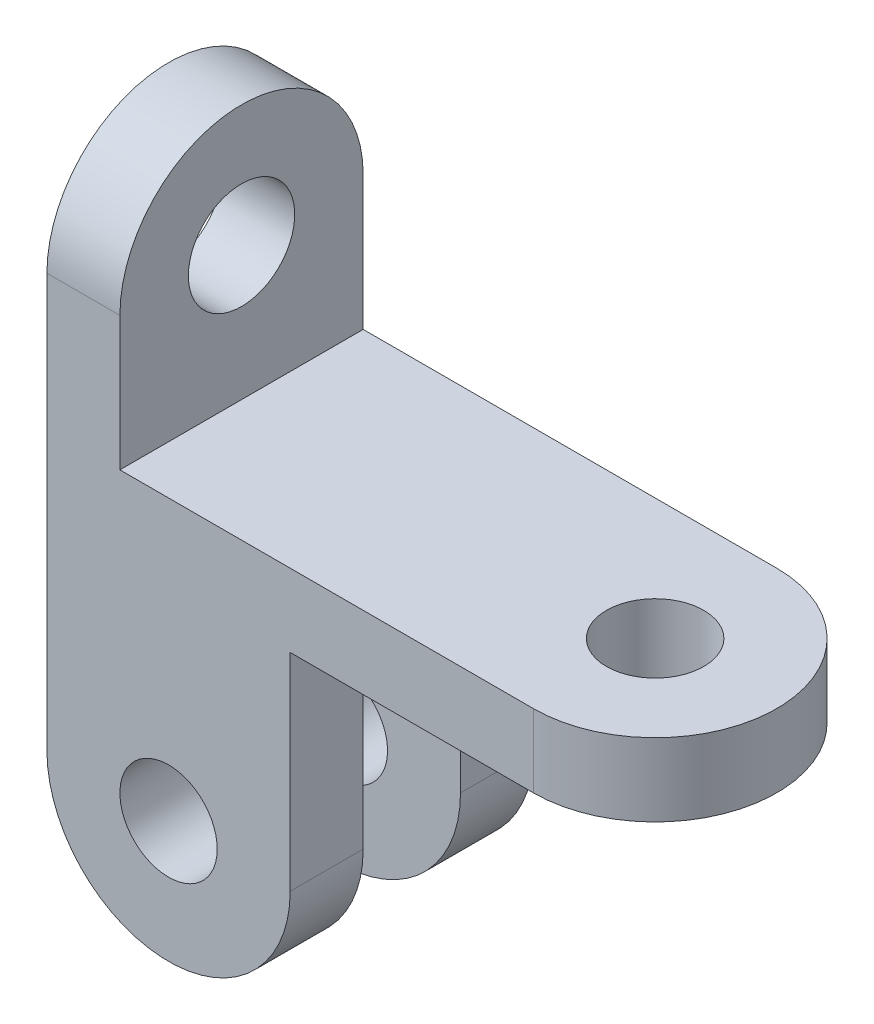
ISO-10303-21;
HEADER;
FILE_DESCRIPTION(('STEP AP214'),'2;1');
FILE_NAME('part.step','',(''),(''),'','','');
FILE_SCHEMA(('AUTOMOTIVE_DESIGN { 1 0 10303 214 1 1 1 1 }'));
ENDSEC;
DATA;
#1=APPLICATION_CONTEXT('core data for automotive mechanical design processes');
#2=APPLICATION_PROTOCOL_DEFINITION('international standard','automotive_design',2000,#1);
#3=PRODUCT_CONTEXT('',#1,'mechanical');
#4=PRODUCT('Part','Part','',(#3));
#5=PRODUCT_RELATED_PRODUCT_CATEGORY('part','',(#4));
#6=PRODUCT_DEFINITION_FORMATION('','',#4);
#7=PRODUCT_DEFINITION_CONTEXT('part definition',#1,'design');
#8=PRODUCT_DEFINITION('design','',#6,#7);
#9=PRODUCT_DEFINITION_SHAPE('','',#8);
#10=(LENGTH_UNIT() NAMED_UNIT(*) SI_UNIT(.MILLI.,.METRE.));
#11=(NAMED_UNIT(*) PLANE_ANGLE_UNIT() SI_UNIT($,.RADIAN.));
#12=(NAMED_UNIT(*) SI_UNIT($,.STERADIAN.) SOLID_ANGLE_UNIT());
#13=UNCERTAINTY_MEASURE_WITH_UNIT(LENGTH_MEASURE(1.E-05),#10,'distance_accuracy_value','');
#14=(GEOMETRIC_REPRESENTATION_CONTEXT(3) GLOBAL_UNCERTAINTY_ASSIGNED_CONTEXT((#13)) GLOBAL_UNIT_ASSIGNED_CONTEXT((#10,
#11,#12)) REPRESENTATION_CONTEXT('',''));
#15=CARTESIAN_POINT('',(0.,0.,0.));
#16=DIRECTION('',(0.,0.,1.));
#17=DIRECTION('',(1.,0.,0.));
#18=AXIS2_PLACEMENT_3D('',#15,#16,#17);
#19=CARTESIAN_POINT('',(15.2845528455285,12.,2.19512195121952));
#20=DIRECTION('',(0.,1.,0.));
#21=DIRECTION('',(0.,0.,1.));
#22=AXIS2_PLACEMENT_3D('',#19,#20,#21);
#23=PLANE('',#22);
#24=DIRECTION('',(0.,0.,-1.));
#25=VECTOR('',#24,1.);
#26=CARTESIAN_POINT('',(-52.7154471544715,12.,0.));
#27=LINE('',#26,#25);
#28=CARTESIAN_POINT('',(-52.7154471544715,12.,22.1951219512195));
#29=VERTEX_POINT('',#28);
#30=CARTESIAN_POINT('',(-52.7154471544715,12.,-17.8048780487805));
#31=VERTEX_POINT('',#30);
#32=EDGE_CURVE('E202',#29,#31,#27,.T.);
#33=ORIENTED_EDGE('',*,*,#32,.F.);
#34=DIRECTION('',(1.,0.,0.));
#35=VECTOR('',#34,1.);
#36=CARTESIAN_POINT('',(-64.7154471544716,12.,22.1951219512195));
#37=LINE('',#36,#35);
#38=CARTESIAN_POINT('',(15.2845528455285,12.,22.1951219512195));
#39=VERTEX_POINT('',#38);
#40=EDGE_CURVE('E228',#29,#39,#37,.T.);
#41=ORIENTED_EDGE('',*,*,#40,.T.);
#42=CARTESIAN_POINT('',(15.2845528455285,12.,2.19512195121952));
#43=DIRECTION('',(0.,1.,0.));
#44=DIRECTION('',(0.,0.,1.));
#45=AXIS2_PLACEMENT_3D('',#42,#43,#44);
#46=CIRCLE('',#45,20.);
#47=CARTESIAN_POINT('',(15.2845528455285,12.,-17.8048780487805));
#48=VERTEX_POINT('',#47);
#49=EDGE_CURVE('E222',#39,#48,#46,.T.);
#50=ORIENTED_EDGE('',*,*,#49,.T.);
#51=DIRECTION('',(-1.,0.,0.));
#52=VECTOR('',#51,1.);
#53=CARTESIAN_POINT('',(-64.7154471544715,12.,-17.8048780487805));
#54=LINE('',#53,#52);
#55=EDGE_CURVE('E225',#48,#31,#54,.T.);
#56=ORIENTED_EDGE('',*,*,#55,.T.);
#57=EDGE_LOOP('',(#33,#41,#50,#56));
#58=FACE_BOUND('',#57,.T.);
#59=CARTESIAN_POINT('',(15.2845528455285,12.,2.19512195121952));
#60=DIRECTION('',(0.,1.,0.));
#61=DIRECTION('',(0.,0.,1.));
#62=AXIS2_PLACEMENT_3D('',#59,#60,#61);
#63=CIRCLE('',#62,8.);
#64=CARTESIAN_POINT('',(15.2845528455285,12.,10.1951219512195));
#65=VERTEX_POINT('',#64);
#66=EDGE_CURVE('E216',#65,#65,#63,.T.);
#67=ORIENTED_EDGE('',*,*,#66,.F.);
#68=EDGE_LOOP('',(#67));
#69=FACE_BOUND('',#68,.T.);
#70=ADVANCED_FACE('F35',(#58,#69),#23,.T.);
#71=CARTESIAN_POINT('',(15.2845528455285,0.,2.19512195121952));
#72=DIRECTION('',(0.,1.,0.));
#73=DIRECTION('',(0.,0.,1.));
#74=AXIS2_PLACEMENT_3D('',#71,#72,#73);
#75=PLANE('',#74);
#76=DIRECTION('',(1.,0.,0.));
#77=VECTOR('',#76,1.);
#78=CARTESIAN_POINT('',(-64.7154471544716,0.,22.1951219512195));
#79=LINE('',#78,#77);
#80=CARTESIAN_POINT('',(-24.7154471544715,0.,22.1951219512195));
#81=VERTEX_POINT('',#80);
#82=CARTESIAN_POINT('',(15.2845528455285,0.,22.1951219512195));
#83=VERTEX_POINT('',#82);
#84=EDGE_CURVE('E226',#81,#83,#79,.T.);
#85=ORIENTED_EDGE('',*,*,#84,.F.);
#86=DIRECTION('',(0.,0.,1.));
#87=VECTOR('',#86,1.);
#88=CARTESIAN_POINT('',(-24.7154471544715,0.,10.1951219512195));
#89=LINE('',#88,#87);
#90=CARTESIAN_POINT('',(-24.7154471544715,0.,10.1951219512195));
#91=VERTEX_POINT('',#90);
#92=EDGE_CURVE('E132',#91,#81,#89,.T.);
#93=ORIENTED_EDGE('',*,*,#92,.F.);
#94=DIRECTION('',(-1.,0.,0.));
#95=VECTOR('',#94,1.);
#96=CARTESIAN_POINT('',(-24.7154471544715,0.,10.1951219512195));
#97=LINE('',#96,#95);
#98=CARTESIAN_POINT('',(-64.7154471544716,0.,10.1951219512195));
#99=VERTEX_POINT('',#98);
#100=EDGE_CURVE('E141',#91,#99,#97,.T.);
#101=ORIENTED_EDGE('',*,*,#100,.T.);
#102=DIRECTION('',(0.,0.,1.));
#103=VECTOR('',#102,1.);
#104=CARTESIAN_POINT('',(-64.7154471544715,0.,-17.8048780487805));
#105=LINE('',#104,#103);
#106=CARTESIAN_POINT('',(-64.7154471544715,0.,-5.80487804878048));
#107=VERTEX_POINT('',#106);
#108=EDGE_CURVE('E236',#107,#99,#105,.T.);
#109=ORIENTED_EDGE('',*,*,#108,.F.);
#110=DIRECTION('',(1.,0.,0.));
#111=VECTOR('',#110,1.);
#112=CARTESIAN_POINT('',(-24.7154471544715,0.,-5.80487804878048));
#113=LINE('',#112,#111);
#114=CARTESIAN_POINT('',(-24.7154471544715,0.,-5.80487804878048));
#115=VERTEX_POINT('',#114);
#116=EDGE_CURVE('E172',#107,#115,#113,.T.);
#117=ORIENTED_EDGE('',*,*,#116,.T.);
#118=DIRECTION('',(0.,0.,-1.));
#119=VECTOR('',#118,1.);
#120=CARTESIAN_POINT('',(-24.7154471544715,0.,-5.80487804878048));
#121=LINE('',#120,#119);
#122=CARTESIAN_POINT('',(-24.7154471544715,0.,-17.8048780487805));
#123=VERTEX_POINT('',#122);
#124=EDGE_CURVE('E185',#115,#123,#121,.T.);
#125=ORIENTED_EDGE('',*,*,#124,.T.);
#126=DIRECTION('',(-1.,0.,0.));
#127=VECTOR('',#126,1.);
#128=CARTESIAN_POINT('',(-64.7154471544715,0.,-17.8048780487805));
#129=LINE('',#128,#127);
#130=CARTESIAN_POINT('',(15.2845528455285,0.,-17.8048780487805));
#131=VERTEX_POINT('',#130);
#132=EDGE_CURVE('E233',#131,#123,#129,.T.);
#133=ORIENTED_EDGE('',*,*,#132,.F.);
#134=CARTESIAN_POINT('',(15.2845528455285,0.,2.19512195121952));
#135=DIRECTION('',(0.,1.,0.));
#136=DIRECTION('',(0.,0.,1.));
#137=AXIS2_PLACEMENT_3D('',#134,#135,#136);
#138=CIRCLE('',#137,20.);
#139=EDGE_CURVE('E219',#83,#131,#138,.T.);
#140=ORIENTED_EDGE('',*,*,#139,.F.);
#141=EDGE_LOOP('',(#85,#93,#101,#109,#117,#125,#133,#140));
#142=FACE_BOUND('',#141,.T.);
#143=CARTESIAN_POINT('',(15.2845528455285,0.,2.19512195121952));
#144=DIRECTION('',(0.,1.,0.));
#145=DIRECTION('',(0.,0.,1.));
#146=AXIS2_PLACEMENT_3D('',#143,#144,#145);
#147=CIRCLE('',#146,8.);
#148=CARTESIAN_POINT('',(15.2845528455285,0.,10.1951219512195));
#149=VERTEX_POINT('',#148);
#150=EDGE_CURVE('E213',#149,#149,#147,.T.);
#151=ORIENTED_EDGE('',*,*,#150,.T.);
#152=EDGE_LOOP('',(#151));
#153=FACE_BOUND('',#152,.T.);
#154=ADVANCED_FACE('F259',(#142,#153),#75,.F.);
#155=CARTESIAN_POINT('',(15.2845528455285,12.,2.19512195121952));
#156=DIRECTION('',(0.,-1.,0.));
#157=DIRECTION('',(0.,0.,-1.));
#158=AXIS2_PLACEMENT_3D('',#155,#156,#157);
#159=CYLINDRICAL_SURFACE('',#158,20.);
#160=ORIENTED_EDGE('',*,*,#139,.T.);
#161=DIRECTION('',(0.,-1.,0.));
#162=VECTOR('',#161,1.);
#163=CARTESIAN_POINT('',(15.2845528455285,12.,-17.8048780487805));
#164=LINE('',#163,#162);
#165=EDGE_CURVE('E11',#48,#131,#164,.T.);
#166=ORIENTED_EDGE('',*,*,#165,.F.);
#167=ORIENTED_EDGE('',*,*,#49,.F.);
#168=DIRECTION('',(0.,-1.,0.));
#169=VECTOR('',#168,1.);
#170=CARTESIAN_POINT('',(15.2845528455285,12.,22.1951219512195));
#171=LINE('',#170,#169);
#172=EDGE_CURVE('E230',#39,#83,#171,.T.);
#173=ORIENTED_EDGE('',*,*,#172,.T.);
#174=EDGE_LOOP('',(#160,#166,#167,#173));
#175=FACE_BOUND('',#174,.T.);
#176=ADVANCED_FACE('F37',(#175),#159,.T.);
#177=CARTESIAN_POINT('',(-64.7154471544715,12.,-17.8048780487805));
#178=DIRECTION('',(0.,0.,1.));
#179=DIRECTION('',(1.,0.,0.));
#180=AXIS2_PLACEMENT_3D('',#177,#178,#179);
#181=PLANE('',#180);
#182=ORIENTED_EDGE('',*,*,#132,.T.);
#183=DIRECTION('',(0.,-1.,0.));
#184=VECTOR('',#183,1.);
#185=CARTESIAN_POINT('',(-24.7154471544715,-34.,-17.8048780487805));
#186=LINE('',#185,#184);
#187=CARTESIAN_POINT('',(-24.7154471544715,-34.,-17.8048780487805));
#188=VERTEX_POINT('',#187);
#189=EDGE_CURVE('E58',#123,#188,#186,.T.);
#190=ORIENTED_EDGE('',*,*,#189,.T.);
#191=CARTESIAN_POINT('',(-44.7154471544715,-34.,-17.8048780487805));
#192=DIRECTION('',(0.,0.,-1.));
#193=DIRECTION('',(-1.,0.,0.));
#194=AXIS2_PLACEMENT_3D('',#191,#192,#193);
#195=CIRCLE('',#194,20.);
#196=CARTESIAN_POINT('',(-64.7154471544715,-34.,-17.8048780487805));
#197=VERTEX_POINT('',#196);
#198=EDGE_CURVE('E163',#188,#197,#195,.T.);
#199=ORIENTED_EDGE('',*,*,#198,.T.);
#200=DIRECTION('',(0.,-1.,0.));
#201=VECTOR('',#200,1.);
#202=CARTESIAN_POINT('',(-64.7154471544715,12.,-17.8048780487805));
#203=LINE('',#202,#201);
#204=CARTESIAN_POINT('',(-64.7154471544715,34.,-17.8048780487805));
#205=VERTEX_POINT('',#204);
#206=EDGE_CURVE('E43',#205,#197,#203,.T.);
#207=ORIENTED_EDGE('',*,*,#206,.F.);
#208=DIRECTION('',(-1.,0.,0.));
#209=VECTOR('',#208,1.);
#210=CARTESIAN_POINT('',(-52.7154471544715,34.,-17.8048780487805));
#211=LINE('',#210,#209);
#212=CARTESIAN_POINT('',(-52.7154471544715,34.,-17.8048780487805));
#213=VERTEX_POINT('',#212);
#214=EDGE_CURVE('E210',#213,#205,#211,.T.);
#215=ORIENTED_EDGE('',*,*,#214,.F.);
#216=DIRECTION('',(0.,-1.,0.));
#217=VECTOR('',#216,1.);
#218=CARTESIAN_POINT('',(-52.7154471544715,0.,-17.8048780487805));
#219=LINE('',#218,#217);
#220=EDGE_CURVE('E199',#213,#31,#219,.T.);
#221=ORIENTED_EDGE('',*,*,#220,.T.);
#222=ORIENTED_EDGE('',*,*,#55,.F.);
#223=ORIENTED_EDGE('',*,*,#165,.T.);
#224=EDGE_LOOP('',(#182,#190,#199,#207,#215,#221,#222,#223));
#225=FACE_BOUND('',#224,.T.);
#226=CARTESIAN_POINT('',(-44.7154471544715,-34.,-17.8048780487805));
#227=DIRECTION('',(0.,0.,-1.));
#228=DIRECTION('',(-1.,0.,0.));
#229=AXIS2_PLACEMENT_3D('',#226,#227,#228);
#230=CIRCLE('',#229,8.);
#231=CARTESIAN_POINT('',(-52.7154471544715,-34.,-17.8048780487805));
#232=VERTEX_POINT('',#231);
#233=EDGE_CURVE('E158',#232,#232,#230,.T.);
#234=ORIENTED_EDGE('',*,*,#233,.F.);
#235=EDGE_LOOP('',(#234));
#236=FACE_BOUND('',#235,.T.);
#237=ADVANCED_FACE('F253',(#225,#236),#181,.F.);
#238=CARTESIAN_POINT('',(-64.7154471544715,12.,-17.8048780487805));
#239=DIRECTION('',(1.,0.,0.));
#240=DIRECTION('',(0.,0.,-1.));
#241=AXIS2_PLACEMENT_3D('',#238,#239,#240);
#242=PLANE('',#241);
#243=ORIENTED_EDGE('',*,*,#206,.T.);
#244=DIRECTION('',(0.,0.,-1.));
#245=VECTOR('',#244,1.);
#246=CARTESIAN_POINT('',(-64.7154471544715,-34.,-5.80487804878048));
#247=LINE('',#246,#245);
#248=CARTESIAN_POINT('',(-64.7154471544715,-34.,-5.80487804878048));
#249=VERTEX_POINT('',#248);
#250=EDGE_CURVE('E178',#249,#197,#247,.T.);
#251=ORIENTED_EDGE('',*,*,#250,.F.);
#252=DIRECTION('',(0.,1.,0.));
#253=VECTOR('',#252,1.);
#254=CARTESIAN_POINT('',(-64.7154471544715,0.,-5.80487804878048));
#255=LINE('',#254,#253);
#256=EDGE_CURVE('E169',#249,#107,#255,.T.);
#257=ORIENTED_EDGE('',*,*,#256,.T.);
#258=ORIENTED_EDGE('',*,*,#108,.T.);
#259=DIRECTION('',(0.,-1.,0.));
#260=VECTOR('',#259,1.);
#261=CARTESIAN_POINT('',(-64.7154471544716,0.,10.1951219512195));
#262=LINE('',#261,#260);
#263=CARTESIAN_POINT('',(-64.7154471544715,-34.,10.1951219512195));
#264=VERTEX_POINT('',#263);
#265=EDGE_CURVE('E133',#99,#264,#262,.T.);
#266=ORIENTED_EDGE('',*,*,#265,.T.);
#267=DIRECTION('',(0.,0.,1.));
#268=VECTOR('',#267,1.);
#269=CARTESIAN_POINT('',(-64.7154471544715,-34.,10.1951219512195));
#270=LINE('',#269,#268);
#271=CARTESIAN_POINT('',(-64.7154471544715,-34.,22.1951219512195));
#272=VERTEX_POINT('',#271);
#273=EDGE_CURVE('E145',#264,#272,#270,.T.);
#274=ORIENTED_EDGE('',*,*,#273,.T.);
#275=DIRECTION('',(0.,-1.,0.));
#276=VECTOR('',#275,1.);
#277=CARTESIAN_POINT('',(-64.7154471544716,12.,22.1951219512195));
#278=LINE('',#277,#276);
#279=CARTESIAN_POINT('',(-64.7154471544715,34.,22.1951219512195));
#280=VERTEX_POINT('',#279);
#281=EDGE_CURVE('E242',#280,#272,#278,.T.);
#282=ORIENTED_EDGE('',*,*,#281,.F.);
#283=CARTESIAN_POINT('',(-64.7154471544715,34.,2.19512195121952));
#284=DIRECTION('',(-1.,0.,0.));
#285=DIRECTION('',(0.,0.,1.));
#286=AXIS2_PLACEMENT_3D('',#283,#284,#285);
#287=CIRCLE('',#286,20.);
#288=EDGE_CURVE('E193',#280,#205,#287,.T.);
#289=ORIENTED_EDGE('',*,*,#288,.T.);
#290=EDGE_LOOP('',(#243,#251,#257,#258,#266,#274,#282,#289));
#291=FACE_BOUND('',#290,.T.);
#292=CARTESIAN_POINT('',(-64.7154471544715,34.,2.19512195121952));
#293=DIRECTION('',(-1.,0.,0.));
#294=DIRECTION('',(0.,0.,1.));
#295=AXIS2_PLACEMENT_3D('',#292,#293,#294);
#296=CIRCLE('',#295,8.74255174933785);
#297=CARTESIAN_POINT('',(-64.7154471544715,34.,10.9376737005574));
#298=VERTEX_POINT('',#297);
#299=EDGE_CURVE('E184',#298,#298,#296,.T.);
#300=ORIENTED_EDGE('',*,*,#299,.F.);
#301=EDGE_LOOP('',(#300));
#302=FACE_BOUND('',#301,.T.);
#303=ADVANCED_FACE('F244',(#291,#302),#242,.F.);
#304=CARTESIAN_POINT('',(-64.7154471544716,12.,22.1951219512195));
#305=DIRECTION('',(0.,0.,-1.));
#306=DIRECTION('',(-1.,0.,0.));
#307=AXIS2_PLACEMENT_3D('',#304,#305,#306);
#308=PLANE('',#307);
#309=ORIENTED_EDGE('',*,*,#281,.T.);
#310=CARTESIAN_POINT('',(-44.7154471544715,-34.,22.1951219512195));
#311=DIRECTION('',(0.,0.,1.));
#312=DIRECTION('',(1.,0.,0.));
#313=AXIS2_PLACEMENT_3D('',#310,#311,#312);
#314=CIRCLE('',#313,20.);
#315=CARTESIAN_POINT('',(-24.7154471544715,-34.,22.1951219512195));
#316=VERTEX_POINT('',#315);
#317=EDGE_CURVE('E147',#272,#316,#314,.T.);
#318=ORIENTED_EDGE('',*,*,#317,.T.);
#319=DIRECTION('',(0.,1.,0.));
#320=VECTOR('',#319,1.);
#321=CARTESIAN_POINT('',(-24.7154471544715,0.,22.1951219512195));
#322=LINE('',#321,#320);
#323=EDGE_CURVE('E50',#316,#81,#322,.T.);
#324=ORIENTED_EDGE('',*,*,#323,.T.);
#325=ORIENTED_EDGE('',*,*,#84,.T.);
#326=ORIENTED_EDGE('',*,*,#172,.F.);
#327=ORIENTED_EDGE('',*,*,#40,.F.);
#328=DIRECTION('',(0.,-1.,0.));
#329=VECTOR('',#328,1.);
#330=CARTESIAN_POINT('',(-52.7154471544715,0.,22.1951219512195));
#331=LINE('',#330,#329);
#332=CARTESIAN_POINT('',(-52.7154471544715,34.,22.1951219512195));
#333=VERTEX_POINT('',#332);
#334=EDGE_CURVE('E192',#333,#29,#331,.T.);
#335=ORIENTED_EDGE('',*,*,#334,.F.);
#336=DIRECTION('',(-1.,0.,0.));
#337=VECTOR('',#336,1.);
#338=CARTESIAN_POINT('',(-52.7154471544715,34.,22.1951219512195));
#339=LINE('',#338,#337);
#340=EDGE_CURVE('E205',#333,#280,#339,.T.);
#341=ORIENTED_EDGE('',*,*,#340,.T.);
#342=EDGE_LOOP('',(#309,#318,#324,#325,#326,#327,#335,#341));
#343=FACE_BOUND('',#342,.T.);
#344=CARTESIAN_POINT('',(-44.7154471544715,-34.,22.1951219512195));
#345=DIRECTION('',(0.,0.,1.));
#346=DIRECTION('',(1.,0.,0.));
#347=AXIS2_PLACEMENT_3D('',#344,#345,#346);
#348=CIRCLE('',#347,8.);
#349=CARTESIAN_POINT('',(-36.7154471544715,-34.,22.1951219512195));
#350=VERTEX_POINT('',#349);
#351=EDGE_CURVE('E150',#350,#350,#348,.T.);
#352=ORIENTED_EDGE('',*,*,#351,.F.);
#353=EDGE_LOOP('',(#352));
#354=FACE_BOUND('',#353,.T.);
#355=ADVANCED_FACE('F267',(#343,#354),#308,.F.);
#356=CARTESIAN_POINT('',(15.2845528455285,12.,2.19512195121952));
#357=DIRECTION('',(0.,-1.,0.));
#358=DIRECTION('',(0.,0.,-1.));
#359=AXIS2_PLACEMENT_3D('',#356,#357,#358);
#360=CYLINDRICAL_SURFACE('',#359,8.);
#361=ORIENTED_EDGE('',*,*,#66,.T.);
#362=EDGE_LOOP('',(#361));
#363=FACE_BOUND('',#362,.T.);
#364=ORIENTED_EDGE('',*,*,#150,.F.);
#365=EDGE_LOOP('',(#364));
#366=FACE_BOUND('',#365,.T.);
#367=ADVANCED_FACE('F290',(#363,#366),#360,.F.);
#368=CARTESIAN_POINT('',(-52.7154471544715,34.,2.19512195121952));
#369=DIRECTION('',(-1.,0.,0.));
#370=DIRECTION('',(0.,0.,1.));
#371=AXIS2_PLACEMENT_3D('',#368,#369,#370);
#372=CYLINDRICAL_SURFACE('',#371,8.74255174933785);
#373=CARTESIAN_POINT('',(-52.7154471544715,34.,2.19512195121952));
#374=DIRECTION('',(-1.,0.,0.));
#375=DIRECTION('',(0.,0.,1.));
#376=AXIS2_PLACEMENT_3D('',#373,#374,#375);
#377=CIRCLE('',#376,8.74255174933785);
#378=CARTESIAN_POINT('',(-52.7154471544715,34.,10.9376737005574));
#379=VERTEX_POINT('',#378);
#380=EDGE_CURVE('E189',#379,#379,#377,.T.);
#381=ORIENTED_EDGE('',*,*,#380,.F.);
#382=EDGE_LOOP('',(#381));
#383=FACE_BOUND('',#382,.T.);
#384=ORIENTED_EDGE('',*,*,#299,.T.);
#385=EDGE_LOOP('',(#384));
#386=FACE_BOUND('',#385,.T.);
#387=ADVANCED_FACE('F282',(#383,#386),#372,.F.);
#388=CARTESIAN_POINT('',(-52.7154471544715,34.,2.19512195121952));
#389=DIRECTION('',(-1.,0.,0.));
#390=DIRECTION('',(0.,0.,1.));
#391=AXIS2_PLACEMENT_3D('',#388,#389,#390);
#392=CYLINDRICAL_SURFACE('',#391,20.);
#393=ORIENTED_EDGE('',*,*,#288,.F.);
#394=ORIENTED_EDGE('',*,*,#340,.F.);
#395=CARTESIAN_POINT('',(-52.7154471544715,34.,2.19512195121952));
#396=DIRECTION('',(-1.,0.,0.));
#397=DIRECTION('',(0.,0.,1.));
#398=AXIS2_PLACEMENT_3D('',#395,#396,#397);
#399=CIRCLE('',#398,20.);
#400=EDGE_CURVE('E196',#333,#213,#399,.T.);
#401=ORIENTED_EDGE('',*,*,#400,.T.);
#402=ORIENTED_EDGE('',*,*,#214,.T.);
#403=EDGE_LOOP('',(#393,#394,#401,#402));
#404=FACE_BOUND('',#403,.T.);
#405=ADVANCED_FACE('F280',(#404),#392,.T.);
#406=CARTESIAN_POINT('',(-52.7154471544715,0.,0.));
#407=DIRECTION('',(-1.,0.,0.));
#408=DIRECTION('',(0.,0.,1.));
#409=AXIS2_PLACEMENT_3D('',#406,#407,#408);
#410=PLANE('',#409);
#411=ORIENTED_EDGE('',*,*,#380,.T.);
#412=EDGE_LOOP('',(#411));
#413=FACE_BOUND('',#412,.T.);
#414=ORIENTED_EDGE('',*,*,#334,.T.);
#415=ORIENTED_EDGE('',*,*,#32,.T.);
#416=ORIENTED_EDGE('',*,*,#220,.F.);
#417=ORIENTED_EDGE('',*,*,#400,.F.);
#418=EDGE_LOOP('',(#414,#415,#416,#417));
#419=FACE_BOUND('',#418,.T.);
#420=ADVANCED_FACE('F277',(#413,#419),#410,.F.);
#421=CARTESIAN_POINT('',(-44.7154471544715,-34.,-5.80487804878048));
#422=DIRECTION('',(0.,0.,-1.));
#423=DIRECTION('',(-1.,0.,0.));
#424=AXIS2_PLACEMENT_3D('',#421,#422,#423);
#425=CYLINDRICAL_SURFACE('',#424,20.);
#426=ORIENTED_EDGE('',*,*,#198,.F.);
#427=DIRECTION('',(0.,0.,-1.));
#428=VECTOR('',#427,1.);
#429=CARTESIAN_POINT('',(-24.7154471544715,-34.,-5.80487804878048));
#430=LINE('',#429,#428);
#431=CARTESIAN_POINT('',(-24.7154471544715,-34.,-5.80487804878048));
#432=VERTEX_POINT('',#431);
#433=EDGE_CURVE('E182',#432,#188,#430,.T.);
#434=ORIENTED_EDGE('',*,*,#433,.F.);
#435=CARTESIAN_POINT('',(-44.7154471544715,-34.,-5.80487804878048));
#436=DIRECTION('',(0.,0.,-1.));
#437=DIRECTION('',(-1.,0.,0.));
#438=AXIS2_PLACEMENT_3D('',#435,#436,#437);
#439=CIRCLE('',#438,20.);
#440=EDGE_CURVE('E166',#432,#249,#439,.T.);
#441=ORIENTED_EDGE('',*,*,#440,.T.);
#442=ORIENTED_EDGE('',*,*,#250,.T.);
#443=EDGE_LOOP('',(#426,#434,#441,#442));
#444=FACE_BOUND('',#443,.T.);
#445=ADVANCED_FACE('F251',(#444),#425,.T.);
#446=CARTESIAN_POINT('',(-24.7154471544715,-34.,-5.80487804878048));
#447=DIRECTION('',(1.,0.,0.));
#448=DIRECTION('',(0.,1.,0.));
#449=AXIS2_PLACEMENT_3D('',#446,#447,#448);
#450=PLANE('',#449);
#451=ORIENTED_EDGE('',*,*,#189,.F.);
#452=ORIENTED_EDGE('',*,*,#124,.F.);
#453=DIRECTION('',(0.,-1.,0.));
#454=VECTOR('',#453,1.);
#455=CARTESIAN_POINT('',(-24.7154471544715,-34.,-5.80487804878048));
#456=LINE('',#455,#454);
#457=EDGE_CURVE('E175',#115,#432,#456,.T.);
#458=ORIENTED_EDGE('',*,*,#457,.T.);
#459=ORIENTED_EDGE('',*,*,#433,.T.);
#460=EDGE_LOOP('',(#451,#452,#458,#459));
#461=FACE_BOUND('',#460,.T.);
#462=ADVANCED_FACE('F263',(#461),#450,.T.);
#463=CARTESIAN_POINT('',(-44.7154471544715,-34.,-5.80487804878048));
#464=DIRECTION('',(0.,0.,-1.));
#465=DIRECTION('',(-1.,0.,0.));
#466=AXIS2_PLACEMENT_3D('',#463,#464,#465);
#467=PLANE('',#466);
#468=CARTESIAN_POINT('',(-44.7154471544715,-34.,-5.80487804878048));
#469=DIRECTION('',(0.,0.,-1.));
#470=DIRECTION('',(-1.,0.,0.));
#471=AXIS2_PLACEMENT_3D('',#468,#469,#470);
#472=CIRCLE('',#471,8.);
#473=CARTESIAN_POINT('',(-52.7154471544715,-34.,-5.80487804878048));
#474=VERTEX_POINT('',#473);
#475=EDGE_CURVE('E160',#474,#474,#472,.T.);
#476=ORIENTED_EDGE('',*,*,#475,.T.);
#477=EDGE_LOOP('',(#476));
#478=FACE_BOUND('',#477,.T.);
#479=ORIENTED_EDGE('',*,*,#440,.F.);
#480=ORIENTED_EDGE('',*,*,#457,.F.);
#481=ORIENTED_EDGE('',*,*,#116,.F.);
#482=ORIENTED_EDGE('',*,*,#256,.F.);
#483=EDGE_LOOP('',(#479,#480,#481,#482));
#484=FACE_BOUND('',#483,.T.);
#485=ADVANCED_FACE('F265',(#478,#484),#467,.F.);
#486=CARTESIAN_POINT('',(-44.7154471544715,-34.,-5.80487804878048));
#487=DIRECTION('',(0.,0.,-1.));
#488=DIRECTION('',(-1.,0.,0.));
#489=AXIS2_PLACEMENT_3D('',#486,#487,#488);
#490=CYLINDRICAL_SURFACE('',#489,8.);
#491=ORIENTED_EDGE('',*,*,#475,.F.);
#492=EDGE_LOOP('',(#491));
#493=FACE_BOUND('',#492,.T.);
#494=ORIENTED_EDGE('',*,*,#233,.T.);
#495=EDGE_LOOP('',(#494));
#496=FACE_BOUND('',#495,.T.);
#497=ADVANCED_FACE('F322',(#493,#496),#490,.F.);
#498=CARTESIAN_POINT('',(-44.7154471544715,-34.,10.1951219512195));
#499=DIRECTION('',(0.,0.,1.));
#500=DIRECTION('',(1.,0.,0.));
#501=AXIS2_PLACEMENT_3D('',#498,#499,#500);
#502=CYLINDRICAL_SURFACE('',#501,20.);
#503=ORIENTED_EDGE('',*,*,#317,.F.);
#504=ORIENTED_EDGE('',*,*,#273,.F.);
#505=CARTESIAN_POINT('',(-44.7154471544715,-34.,10.1951219512195));
#506=DIRECTION('',(0.,0.,1.));
#507=DIRECTION('',(1.,0.,0.));
#508=AXIS2_PLACEMENT_3D('',#505,#506,#507);
#509=CIRCLE('',#508,20.);
#510=CARTESIAN_POINT('',(-24.7154471544715,-34.,10.1951219512195));
#511=VERTEX_POINT('',#510);
#512=EDGE_CURVE('E138',#264,#511,#509,.T.);
#513=ORIENTED_EDGE('',*,*,#512,.T.);
#514=DIRECTION('',(0.,0.,1.));
#515=VECTOR('',#514,1.);
#516=CARTESIAN_POINT('',(-24.7154471544715,-34.,10.1951219512195));
#517=LINE('',#516,#515);
#518=EDGE_CURVE('E124',#511,#316,#517,.T.);
#519=ORIENTED_EDGE('',*,*,#518,.T.);
#520=EDGE_LOOP('',(#503,#504,#513,#519));
#521=FACE_BOUND('',#520,.T.);
#522=ADVANCED_FACE('F143',(#521),#502,.T.);
#523=CARTESIAN_POINT('',(-24.7154471544715,0.,10.1951219512195));
#524=DIRECTION('',(1.,0.,0.));
#525=DIRECTION('',(0.,1.,0.));
#526=AXIS2_PLACEMENT_3D('',#523,#524,#525);
#527=PLANE('',#526);
#528=ORIENTED_EDGE('',*,*,#323,.F.);
#529=ORIENTED_EDGE('',*,*,#518,.F.);
#530=DIRECTION('',(0.,1.,0.));
#531=VECTOR('',#530,1.);
#532=CARTESIAN_POINT('',(-24.7154471544715,0.,10.1951219512195));
#533=LINE('',#532,#531);
#534=EDGE_CURVE('E127',#511,#91,#533,.T.);
#535=ORIENTED_EDGE('',*,*,#534,.T.);
#536=ORIENTED_EDGE('',*,*,#92,.T.);
#537=EDGE_LOOP('',(#528,#529,#535,#536));
#538=FACE_BOUND('',#537,.T.);
#539=ADVANCED_FACE('F126',(#538),#527,.T.);
#540=CARTESIAN_POINT('',(-44.7154471544715,-34.,10.1951219512195));
#541=DIRECTION('',(0.,0.,1.));
#542=DIRECTION('',(1.,0.,0.));
#543=AXIS2_PLACEMENT_3D('',#540,#541,#542);
#544=PLANE('',#543);
#545=CARTESIAN_POINT('',(-44.7154471544715,-34.,10.1951219512195));
#546=DIRECTION('',(0.,0.,1.));
#547=DIRECTION('',(1.,0.,0.));
#548=AXIS2_PLACEMENT_3D('',#545,#546,#547);
#549=CIRCLE('',#548,8.);
#550=CARTESIAN_POINT('',(-36.7154471544715,-34.,10.1951219512195));
#551=VERTEX_POINT('',#550);
#552=EDGE_CURVE('E155',#551,#551,#549,.T.);
#553=ORIENTED_EDGE('',*,*,#552,.T.);
#554=EDGE_LOOP('',(#553));
#555=FACE_BOUND('',#554,.T.);
#556=ORIENTED_EDGE('',*,*,#512,.F.);
#557=ORIENTED_EDGE('',*,*,#265,.F.);
#558=ORIENTED_EDGE('',*,*,#100,.F.);
#559=ORIENTED_EDGE('',*,*,#534,.F.);
#560=EDGE_LOOP('',(#556,#557,#558,#559));
#561=FACE_BOUND('',#560,.T.);
#562=ADVANCED_FACE('F137',(#555,#561),#544,.F.);
#563=CARTESIAN_POINT('',(-44.7154471544715,-34.,10.1951219512195));
#564=DIRECTION('',(0.,0.,1.));
#565=DIRECTION('',(1.,0.,0.));
#566=AXIS2_PLACEMENT_3D('',#563,#564,#565);
#567=CYLINDRICAL_SURFACE('',#566,8.);
#568=ORIENTED_EDGE('',*,*,#552,.F.);
#569=EDGE_LOOP('',(#568));
#570=FACE_BOUND('',#569,.T.);
#571=ORIENTED_EDGE('',*,*,#351,.T.);
#572=EDGE_LOOP('',(#571));
#573=FACE_BOUND('',#572,.T.);
#574=ADVANCED_FACE('F362',(#570,#573),#567,.F.);
#575=CLOSED_SHELL('',(#70,#154,#176,#237,#303,#355,#367,#387,#405,#420,#445,#462,#485,#497,#522,
#539,#562,#574));
#576=MANIFOLD_SOLID_BREP('B2',#575);
#577=ADVANCED_BREP_SHAPE_REPRESENTATION('',(#18,#576),#14);
#578=SHAPE_DEFINITION_REPRESENTATION(#9,#577);
ENDSEC;
END-ISO-10303-21;
